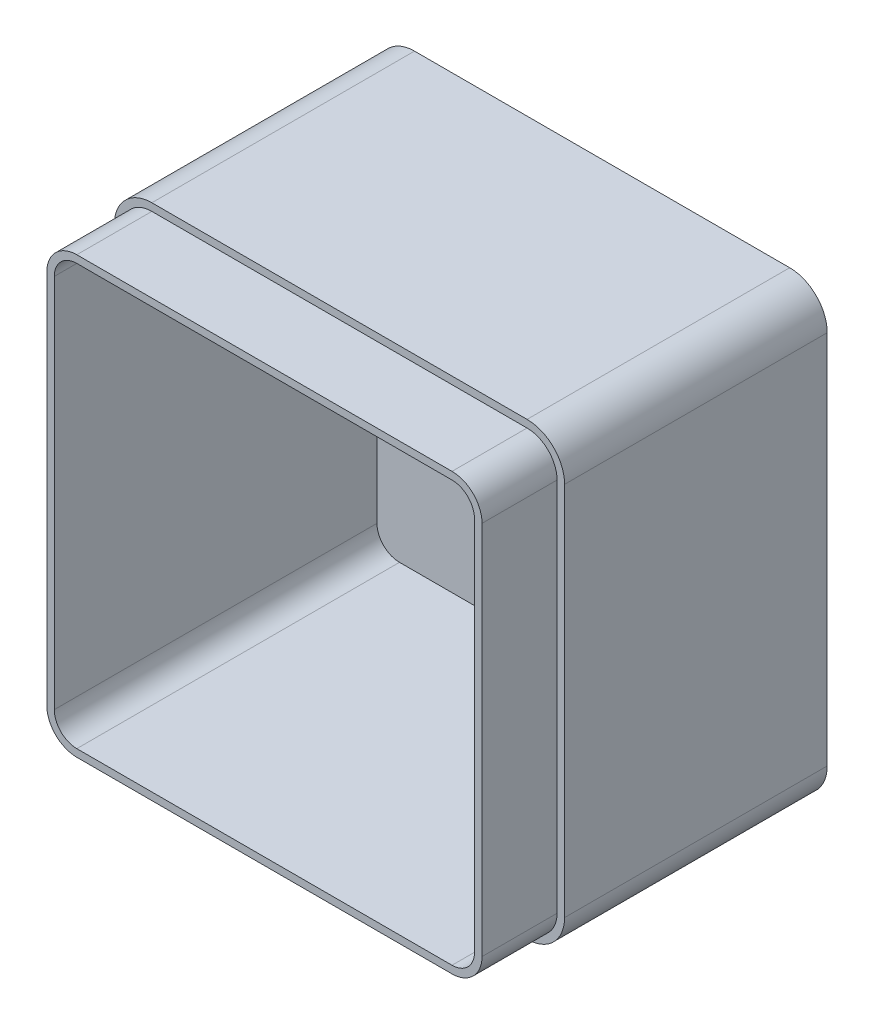
ISO-10303-21;
HEADER;
FILE_DESCRIPTION(('STEP AP214'),'2;1');
FILE_NAME('part.step','',(''),(''),'','','');
FILE_SCHEMA(('AUTOMOTIVE_DESIGN { 1 0 10303 214 1 1 1 1 }'));
ENDSEC;
DATA;
#1=APPLICATION_CONTEXT('core data for automotive mechanical design processes');
#2=APPLICATION_PROTOCOL_DEFINITION('international standard','automotive_design',2000,#1);
#3=PRODUCT_CONTEXT('',#1,'mechanical');
#4=PRODUCT('Part','Part','',(#3));
#5=PRODUCT_RELATED_PRODUCT_CATEGORY('part','',(#4));
#6=PRODUCT_DEFINITION_FORMATION('','',#4);
#7=PRODUCT_DEFINITION_CONTEXT('part definition',#1,'design');
#8=PRODUCT_DEFINITION('design','',#6,#7);
#9=PRODUCT_DEFINITION_SHAPE('','',#8);
#10=(LENGTH_UNIT() NAMED_UNIT(*) SI_UNIT(.MILLI.,.METRE.));
#11=(NAMED_UNIT(*) PLANE_ANGLE_UNIT() SI_UNIT($,.RADIAN.));
#12=(NAMED_UNIT(*) SI_UNIT($,.STERADIAN.) SOLID_ANGLE_UNIT());
#13=UNCERTAINTY_MEASURE_WITH_UNIT(LENGTH_MEASURE(1.E-05),#10,'distance_accuracy_value','');
#14=(GEOMETRIC_REPRESENTATION_CONTEXT(3) GLOBAL_UNCERTAINTY_ASSIGNED_CONTEXT((#13)) GLOBAL_UNIT_ASSIGNED_CONTEXT((#10,
#11,#12)) REPRESENTATION_CONTEXT('',''));
#15=CARTESIAN_POINT('',(0.,0.,0.));
#16=DIRECTION('',(0.,0.,1.));
#17=DIRECTION('',(1.,0.,0.));
#18=AXIS2_PLACEMENT_3D('',#15,#16,#17);
#19=CARTESIAN_POINT('',(0.,0.,90.));
#20=DIRECTION('',(0.,0.,-1.));
#21=DIRECTION('',(-1.,0.,0.));
#22=AXIS2_PLACEMENT_3D('',#19,#20,#21);
#23=PLANE('',#22);
#24=DIRECTION('',(0.,-1.,0.));
#25=VECTOR('',#24,1.);
#26=CARTESIAN_POINT('',(4.,0.,90.));
#27=LINE('',#26,#25);
#28=CARTESIAN_POINT('',(4.,110.,90.));
#29=VERTEX_POINT('',#28);
#30=CARTESIAN_POINT('',(4.,9.99999999999999,90.));
#31=VERTEX_POINT('',#30);
#32=EDGE_CURVE('E304',#29,#31,#27,.T.);
#33=ORIENTED_EDGE('',*,*,#32,.F.);
#34=CARTESIAN_POINT('',(10.,110.,90.));
#35=DIRECTION('',(0.,0.,-1.));
#36=DIRECTION('',(-1.,0.,0.));
#37=AXIS2_PLACEMENT_3D('',#34,#35,#36);
#38=CIRCLE('',#37,6.);
#39=CARTESIAN_POINT('',(9.99999999999999,116.,90.));
#40=VERTEX_POINT('',#39);
#41=EDGE_CURVE('E287',#40,#29,#38,.F.);
#42=ORIENTED_EDGE('',*,*,#41,.F.);
#43=DIRECTION('',(-1.,0.,0.));
#44=VECTOR('',#43,1.);
#45=CARTESIAN_POINT('',(0.,116.,90.));
#46=LINE('',#45,#44);
#47=CARTESIAN_POINT('',(110.,116.,90.));
#48=VERTEX_POINT('',#47);
#49=EDGE_CURVE('E313',#48,#40,#46,.T.);
#50=ORIENTED_EDGE('',*,*,#49,.F.);
#51=CARTESIAN_POINT('',(110.,110.,90.));
#52=DIRECTION('',(0.,0.,-1.));
#53=DIRECTION('',(-1.,0.,0.));
#54=AXIS2_PLACEMENT_3D('',#51,#52,#53);
#55=CIRCLE('',#54,6.);
#56=CARTESIAN_POINT('',(116.,110.,90.));
#57=VERTEX_POINT('',#56);
#58=EDGE_CURVE('E336',#57,#48,#55,.F.);
#59=ORIENTED_EDGE('',*,*,#58,.F.);
#60=DIRECTION('',(0.,1.,0.));
#61=VECTOR('',#60,1.);
#62=CARTESIAN_POINT('',(116.,0.,90.));
#63=LINE('',#62,#61);
#64=CARTESIAN_POINT('',(116.,9.99999999999999,90.));
#65=VERTEX_POINT('',#64);
#66=EDGE_CURVE('E334',#65,#57,#63,.T.);
#67=ORIENTED_EDGE('',*,*,#66,.F.);
#68=CARTESIAN_POINT('',(110.,10.,90.));
#69=DIRECTION('',(0.,0.,-1.));
#70=DIRECTION('',(-1.,0.,0.));
#71=AXIS2_PLACEMENT_3D('',#68,#69,#70);
#72=CIRCLE('',#71,6.);
#73=CARTESIAN_POINT('',(110.,4.,90.));
#74=VERTEX_POINT('',#73);
#75=EDGE_CURVE('E331',#74,#65,#72,.F.);
#76=ORIENTED_EDGE('',*,*,#75,.F.);
#77=DIRECTION('',(1.,0.,0.));
#78=VECTOR('',#77,1.);
#79=CARTESIAN_POINT('',(0.,4.,90.));
#80=LINE('',#79,#78);
#81=CARTESIAN_POINT('',(9.99999999999999,4.,90.));
#82=VERTEX_POINT('',#81);
#83=EDGE_CURVE('E329',#82,#74,#80,.T.);
#84=ORIENTED_EDGE('',*,*,#83,.F.);
#85=CARTESIAN_POINT('',(10.,10.,90.));
#86=DIRECTION('',(0.,0.,-1.));
#87=DIRECTION('',(-1.,0.,0.));
#88=AXIS2_PLACEMENT_3D('',#85,#86,#87);
#89=CIRCLE('',#88,6.);
#90=EDGE_CURVE('E320',#31,#82,#89,.F.);
#91=ORIENTED_EDGE('',*,*,#90,.F.);
#92=EDGE_LOOP('',(#33,#42,#50,#59,#67,#76,#84,#91));
#93=FACE_BOUND('',#92,.T.);
#94=CARTESIAN_POINT('',(10.,110.,90.));
#95=DIRECTION('',(0.,0.,1.));
#96=DIRECTION('',(1.,0.,0.));
#97=AXIS2_PLACEMENT_3D('',#94,#95,#96);
#98=CIRCLE('',#97,8.);
#99=CARTESIAN_POINT('',(9.99999999999999,118.,90.));
#100=VERTEX_POINT('',#99);
#101=CARTESIAN_POINT('',(2.,110.,90.));
#102=VERTEX_POINT('',#101);
#103=EDGE_CURVE('E239',#100,#102,#98,.T.);
#104=ORIENTED_EDGE('',*,*,#103,.T.);
#105=DIRECTION('',(0.,-1.,0.));
#106=VECTOR('',#105,1.);
#107=CARTESIAN_POINT('',(2.,110.,90.));
#108=LINE('',#107,#106);
#109=CARTESIAN_POINT('',(2.,9.99999999999999,90.));
#110=VERTEX_POINT('',#109);
#111=EDGE_CURVE('E199',#102,#110,#108,.T.);
#112=ORIENTED_EDGE('',*,*,#111,.T.);
#113=CARTESIAN_POINT('',(10.,10.,90.));
#114=DIRECTION('',(0.,0.,1.));
#115=DIRECTION('',(1.,0.,0.));
#116=AXIS2_PLACEMENT_3D('',#113,#114,#115);
#117=CIRCLE('',#116,8.);
#118=CARTESIAN_POINT('',(9.99999999999999,2.,90.));
#119=VERTEX_POINT('',#118);
#120=EDGE_CURVE('E48',#110,#119,#117,.T.);
#121=ORIENTED_EDGE('',*,*,#120,.T.);
#122=DIRECTION('',(1.,0.,0.));
#123=VECTOR('',#122,1.);
#124=CARTESIAN_POINT('',(9.99999999999999,2.,90.));
#125=LINE('',#124,#123);
#126=CARTESIAN_POINT('',(110.,2.,90.));
#127=VERTEX_POINT('',#126);
#128=EDGE_CURVE('E243',#119,#127,#125,.T.);
#129=ORIENTED_EDGE('',*,*,#128,.T.);
#130=CARTESIAN_POINT('',(110.,10.,90.));
#131=DIRECTION('',(0.,0.,1.));
#132=DIRECTION('',(1.,0.,0.));
#133=AXIS2_PLACEMENT_3D('',#130,#131,#132);
#134=CIRCLE('',#133,7.99999999999999);
#135=CARTESIAN_POINT('',(118.,10.,90.));
#136=VERTEX_POINT('',#135);
#137=EDGE_CURVE('E246',#127,#136,#134,.T.);
#138=ORIENTED_EDGE('',*,*,#137,.T.);
#139=DIRECTION('',(0.,1.,0.));
#140=VECTOR('',#139,1.);
#141=CARTESIAN_POINT('',(118.,9.99999999999999,90.));
#142=LINE('',#141,#140);
#143=CARTESIAN_POINT('',(118.,110.,90.));
#144=VERTEX_POINT('',#143);
#145=EDGE_CURVE('E249',#136,#144,#142,.T.);
#146=ORIENTED_EDGE('',*,*,#145,.T.);
#147=CARTESIAN_POINT('',(110.,110.,90.));
#148=DIRECTION('',(0.,0.,1.));
#149=DIRECTION('',(1.,0.,0.));
#150=AXIS2_PLACEMENT_3D('',#147,#148,#149);
#151=CIRCLE('',#150,7.99999999999999);
#152=CARTESIAN_POINT('',(110.,118.,90.));
#153=VERTEX_POINT('',#152);
#154=EDGE_CURVE('E222',#144,#153,#151,.T.);
#155=ORIENTED_EDGE('',*,*,#154,.T.);
#156=DIRECTION('',(-1.,0.,0.));
#157=VECTOR('',#156,1.);
#158=CARTESIAN_POINT('',(110.,118.,90.));
#159=LINE('',#158,#157);
#160=EDGE_CURVE('E219',#153,#100,#159,.T.);
#161=ORIENTED_EDGE('',*,*,#160,.T.);
#162=EDGE_LOOP('',(#104,#112,#121,#129,#138,#146,#155,#161));
#163=FACE_BOUND('',#162,.T.);
#164=ADVANCED_FACE('F33',(#93,#163),#23,.F.);
#165=CARTESIAN_POINT('',(4.,0.,90.));
#166=DIRECTION('',(1.,0.,0.));
#167=DIRECTION('',(0.,0.,-1.));
#168=AXIS2_PLACEMENT_3D('',#165,#166,#167);
#169=PLANE('',#168);
#170=DIRECTION('',(0.,-1.,0.));
#171=VECTOR('',#170,1.);
#172=CARTESIAN_POINT('',(4.,0.,4.));
#173=LINE('',#172,#171);
#174=CARTESIAN_POINT('',(4.,110.,4.));
#175=VERTEX_POINT('',#174);
#176=CARTESIAN_POINT('',(4.,9.99999999999999,4.));
#177=VERTEX_POINT('',#176);
#178=EDGE_CURVE('E281',#175,#177,#173,.T.);
#179=ORIENTED_EDGE('',*,*,#178,.F.);
#180=DIRECTION('',(0.,0.,-1.));
#181=VECTOR('',#180,1.);
#182=CARTESIAN_POINT('',(4.,110.,90.));
#183=LINE('',#182,#181);
#184=EDGE_CURVE('E288',#29,#175,#183,.T.);
#185=ORIENTED_EDGE('',*,*,#184,.F.);
#186=ORIENTED_EDGE('',*,*,#32,.T.);
#187=DIRECTION('',(0.,0.,-1.));
#188=VECTOR('',#187,1.);
#189=CARTESIAN_POINT('',(4.,9.99999999999999,90.));
#190=LINE('',#189,#188);
#191=EDGE_CURVE('E285',#177,#31,#190,.F.);
#192=ORIENTED_EDGE('',*,*,#191,.F.);
#193=EDGE_LOOP('',(#179,#185,#186,#192));
#194=FACE_BOUND('',#193,.T.);
#195=ADVANCED_FACE('F427',(#194),#169,.T.);
#196=CARTESIAN_POINT('',(0.,4.,90.));
#197=DIRECTION('',(0.,1.,0.));
#198=DIRECTION('',(0.,0.,1.));
#199=AXIS2_PLACEMENT_3D('',#196,#197,#198);
#200=PLANE('',#199);
#201=ORIENTED_EDGE('',*,*,#83,.T.);
#202=DIRECTION('',(0.,0.,1.));
#203=VECTOR('',#202,1.);
#204=CARTESIAN_POINT('',(110.,4.,90.));
#205=LINE('',#204,#203);
#206=CARTESIAN_POINT('',(110.,4.,4.));
#207=VERTEX_POINT('',#206);
#208=EDGE_CURVE('E311',#207,#74,#205,.T.);
#209=ORIENTED_EDGE('',*,*,#208,.F.);
#210=DIRECTION('',(1.,0.,0.));
#211=VECTOR('',#210,1.);
#212=CARTESIAN_POINT('',(0.,4.,4.));
#213=LINE('',#212,#211);
#214=CARTESIAN_POINT('',(9.99999999999999,4.,4.));
#215=VERTEX_POINT('',#214);
#216=EDGE_CURVE('E284',#215,#207,#213,.T.);
#217=ORIENTED_EDGE('',*,*,#216,.F.);
#218=DIRECTION('',(0.,0.,1.));
#219=VECTOR('',#218,1.);
#220=CARTESIAN_POINT('',(9.99999999999999,4.,90.));
#221=LINE('',#220,#219);
#222=EDGE_CURVE('E300',#82,#215,#221,.F.);
#223=ORIENTED_EDGE('',*,*,#222,.F.);
#224=EDGE_LOOP('',(#201,#209,#217,#223));
#225=FACE_BOUND('',#224,.T.);
#226=ADVANCED_FACE('F433',(#225),#200,.T.);
#227=CARTESIAN_POINT('',(116.,0.,90.));
#228=DIRECTION('',(-1.,0.,0.));
#229=DIRECTION('',(0.,0.,1.));
#230=AXIS2_PLACEMENT_3D('',#227,#228,#229);
#231=PLANE('',#230);
#232=ORIENTED_EDGE('',*,*,#66,.T.);
#233=DIRECTION('',(0.,0.,1.));
#234=VECTOR('',#233,1.);
#235=CARTESIAN_POINT('',(116.,110.,90.));
#236=LINE('',#235,#234);
#237=CARTESIAN_POINT('',(116.,110.,4.));
#238=VERTEX_POINT('',#237);
#239=EDGE_CURVE('E318',#238,#57,#236,.T.);
#240=ORIENTED_EDGE('',*,*,#239,.F.);
#241=DIRECTION('',(0.,1.,0.));
#242=VECTOR('',#241,1.);
#243=CARTESIAN_POINT('',(116.,0.,4.));
#244=LINE('',#243,#242);
#245=CARTESIAN_POINT('',(116.,9.99999999999999,4.));
#246=VERTEX_POINT('',#245);
#247=EDGE_CURVE('E294',#246,#238,#244,.T.);
#248=ORIENTED_EDGE('',*,*,#247,.F.);
#249=DIRECTION('',(0.,0.,1.));
#250=VECTOR('',#249,1.);
#251=CARTESIAN_POINT('',(116.,9.99999999999999,90.));
#252=LINE('',#251,#250);
#253=EDGE_CURVE('E314',#65,#246,#252,.F.);
#254=ORIENTED_EDGE('',*,*,#253,.F.);
#255=EDGE_LOOP('',(#232,#240,#248,#254));
#256=FACE_BOUND('',#255,.T.);
#257=ADVANCED_FACE('F462',(#256),#231,.T.);
#258=CARTESIAN_POINT('',(0.,116.,90.));
#259=DIRECTION('',(0.,-1.,0.));
#260=DIRECTION('',(0.,0.,-1.));
#261=AXIS2_PLACEMENT_3D('',#258,#259,#260);
#262=PLANE('',#261);
#263=ORIENTED_EDGE('',*,*,#49,.T.);
#264=DIRECTION('',(0.,0.,-1.));
#265=VECTOR('',#264,1.);
#266=CARTESIAN_POINT('',(9.99999999999999,116.,90.));
#267=LINE('',#266,#265);
#268=CARTESIAN_POINT('',(9.99999999999999,116.,4.));
#269=VERTEX_POINT('',#268);
#270=EDGE_CURVE('E317',#269,#40,#267,.F.);
#271=ORIENTED_EDGE('',*,*,#270,.F.);
#272=DIRECTION('',(-1.,0.,0.));
#273=VECTOR('',#272,1.);
#274=CARTESIAN_POINT('',(0.,116.,4.));
#275=LINE('',#274,#273);
#276=CARTESIAN_POINT('',(110.,116.,4.));
#277=VERTEX_POINT('',#276);
#278=EDGE_CURVE('E301',#277,#269,#275,.T.);
#279=ORIENTED_EDGE('',*,*,#278,.F.);
#280=DIRECTION('',(0.,0.,-1.));
#281=VECTOR('',#280,1.);
#282=CARTESIAN_POINT('',(110.,116.,90.));
#283=LINE('',#282,#281);
#284=EDGE_CURVE('E321',#48,#277,#283,.T.);
#285=ORIENTED_EDGE('',*,*,#284,.F.);
#286=EDGE_LOOP('',(#263,#271,#279,#285));
#287=FACE_BOUND('',#286,.T.);
#288=ADVANCED_FACE('F458',(#287),#262,.T.);
#289=CARTESIAN_POINT('',(0.,0.,4.));
#290=DIRECTION('',(0.,0.,-1.));
#291=DIRECTION('',(-1.,0.,0.));
#292=AXIS2_PLACEMENT_3D('',#289,#290,#291);
#293=PLANE('',#292);
#294=ORIENTED_EDGE('',*,*,#216,.T.);
#295=CARTESIAN_POINT('',(110.,10.,4.));
#296=DIRECTION('',(0.,0.,-1.));
#297=DIRECTION('',(-1.,0.,0.));
#298=AXIS2_PLACEMENT_3D('',#295,#296,#297);
#299=CIRCLE('',#298,6.);
#300=EDGE_CURVE('E296',#246,#207,#299,.T.);
#301=ORIENTED_EDGE('',*,*,#300,.F.);
#302=ORIENTED_EDGE('',*,*,#247,.T.);
#303=CARTESIAN_POINT('',(110.,110.,4.));
#304=DIRECTION('',(0.,0.,-1.));
#305=DIRECTION('',(-1.,0.,0.));
#306=AXIS2_PLACEMENT_3D('',#303,#304,#305);
#307=CIRCLE('',#306,6.);
#308=EDGE_CURVE('E299',#277,#238,#307,.T.);
#309=ORIENTED_EDGE('',*,*,#308,.F.);
#310=ORIENTED_EDGE('',*,*,#278,.T.);
#311=CARTESIAN_POINT('',(10.,110.,4.));
#312=DIRECTION('',(0.,0.,-1.));
#313=DIRECTION('',(-1.,0.,0.));
#314=AXIS2_PLACEMENT_3D('',#311,#312,#313);
#315=CIRCLE('',#314,6.);
#316=EDGE_CURVE('E297',#175,#269,#315,.T.);
#317=ORIENTED_EDGE('',*,*,#316,.F.);
#318=ORIENTED_EDGE('',*,*,#178,.T.);
#319=CARTESIAN_POINT('',(10.,10.,4.));
#320=DIRECTION('',(0.,0.,-1.));
#321=DIRECTION('',(-1.,0.,0.));
#322=AXIS2_PLACEMENT_3D('',#319,#320,#321);
#323=CIRCLE('',#322,6.);
#324=EDGE_CURVE('E291',#215,#177,#323,.T.);
#325=ORIENTED_EDGE('',*,*,#324,.F.);
#326=EDGE_LOOP('',(#294,#301,#302,#309,#310,#317,#318,#325));
#327=FACE_BOUND('',#326,.T.);
#328=ADVANCED_FACE('F454',(#327),#293,.F.);
#329=CARTESIAN_POINT('',(10.,10.,90.));
#330=DIRECTION('',(0.,0.,-1.));
#331=DIRECTION('',(-1.,0.,0.));
#332=AXIS2_PLACEMENT_3D('',#329,#330,#331);
#333=CYLINDRICAL_SURFACE('',#332,6.);
#334=ORIENTED_EDGE('',*,*,#90,.T.);
#335=ORIENTED_EDGE('',*,*,#222,.T.);
#336=ORIENTED_EDGE('',*,*,#324,.T.);
#337=ORIENTED_EDGE('',*,*,#191,.T.);
#338=EDGE_LOOP('',(#334,#335,#336,#337));
#339=FACE_BOUND('',#338,.T.);
#340=ADVANCED_FACE('F450',(#339),#333,.F.);
#341=CARTESIAN_POINT('',(110.,10.,90.));
#342=DIRECTION('',(0.,0.,-1.));
#343=DIRECTION('',(-1.,0.,0.));
#344=AXIS2_PLACEMENT_3D('',#341,#342,#343);
#345=CYLINDRICAL_SURFACE('',#344,6.);
#346=ORIENTED_EDGE('',*,*,#75,.T.);
#347=ORIENTED_EDGE('',*,*,#253,.T.);
#348=ORIENTED_EDGE('',*,*,#300,.T.);
#349=ORIENTED_EDGE('',*,*,#208,.T.);
#350=EDGE_LOOP('',(#346,#347,#348,#349));
#351=FACE_BOUND('',#350,.T.);
#352=ADVANCED_FACE('F446',(#351),#345,.F.);
#353=CARTESIAN_POINT('',(110.,110.,90.));
#354=DIRECTION('',(0.,0.,-1.));
#355=DIRECTION('',(-1.,0.,0.));
#356=AXIS2_PLACEMENT_3D('',#353,#354,#355);
#357=CYLINDRICAL_SURFACE('',#356,6.);
#358=ORIENTED_EDGE('',*,*,#58,.T.);
#359=ORIENTED_EDGE('',*,*,#284,.T.);
#360=ORIENTED_EDGE('',*,*,#308,.T.);
#361=ORIENTED_EDGE('',*,*,#239,.T.);
#362=EDGE_LOOP('',(#358,#359,#360,#361));
#363=FACE_BOUND('',#362,.T.);
#364=ADVANCED_FACE('F442',(#363),#357,.F.);
#365=CARTESIAN_POINT('',(10.,110.,90.));
#366=DIRECTION('',(0.,0.,-1.));
#367=DIRECTION('',(-1.,0.,0.));
#368=AXIS2_PLACEMENT_3D('',#365,#366,#367);
#369=CYLINDRICAL_SURFACE('',#368,6.);
#370=ORIENTED_EDGE('',*,*,#41,.T.);
#371=ORIENTED_EDGE('',*,*,#184,.T.);
#372=ORIENTED_EDGE('',*,*,#316,.T.);
#373=ORIENTED_EDGE('',*,*,#270,.T.);
#374=EDGE_LOOP('',(#370,#371,#372,#373));
#375=FACE_BOUND('',#374,.T.);
#376=ADVANCED_FACE('F439',(#375),#369,.F.);
#377=CARTESIAN_POINT('',(10.,110.,70.));
#378=DIRECTION('',(0.,0.,1.));
#379=DIRECTION('',(1.,0.,0.));
#380=AXIS2_PLACEMENT_3D('',#377,#378,#379);
#381=PLANE('',#380);
#382=DIRECTION('',(-1.,0.,0.));
#383=VECTOR('',#382,1.);
#384=CARTESIAN_POINT('',(110.,118.,70.));
#385=LINE('',#384,#383);
#386=CARTESIAN_POINT('',(110.,118.,70.));
#387=VERTEX_POINT('',#386);
#388=CARTESIAN_POINT('',(9.99999999999999,118.,70.));
#389=VERTEX_POINT('',#388);
#390=EDGE_CURVE('E205',#387,#389,#385,.T.);
#391=ORIENTED_EDGE('',*,*,#390,.F.);
#392=CARTESIAN_POINT('',(110.,110.,70.));
#393=DIRECTION('',(0.,0.,1.));
#394=DIRECTION('',(1.,0.,0.));
#395=AXIS2_PLACEMENT_3D('',#392,#393,#394);
#396=CIRCLE('',#395,7.99999999999999);
#397=CARTESIAN_POINT('',(118.,110.,70.));
#398=VERTEX_POINT('',#397);
#399=EDGE_CURVE('E235',#398,#387,#396,.T.);
#400=ORIENTED_EDGE('',*,*,#399,.F.);
#401=DIRECTION('',(0.,1.,0.));
#402=VECTOR('',#401,1.);
#403=CARTESIAN_POINT('',(118.,9.99999999999999,70.));
#404=LINE('',#403,#402);
#405=CARTESIAN_POINT('',(118.,10.,70.));
#406=VERTEX_POINT('',#405);
#407=EDGE_CURVE('E232',#406,#398,#404,.T.);
#408=ORIENTED_EDGE('',*,*,#407,.F.);
#409=CARTESIAN_POINT('',(110.,10.,70.));
#410=DIRECTION('',(0.,0.,1.));
#411=DIRECTION('',(1.,0.,0.));
#412=AXIS2_PLACEMENT_3D('',#409,#410,#411);
#413=CIRCLE('',#412,7.99999999999999);
#414=CARTESIAN_POINT('',(110.,2.,70.));
#415=VERTEX_POINT('',#414);
#416=EDGE_CURVE('E229',#415,#406,#413,.T.);
#417=ORIENTED_EDGE('',*,*,#416,.F.);
#418=DIRECTION('',(1.,0.,0.));
#419=VECTOR('',#418,1.);
#420=CARTESIAN_POINT('',(9.99999999999999,2.,70.));
#421=LINE('',#420,#419);
#422=CARTESIAN_POINT('',(9.99999999999999,2.,70.));
#423=VERTEX_POINT('',#422);
#424=EDGE_CURVE('E226',#423,#415,#421,.T.);
#425=ORIENTED_EDGE('',*,*,#424,.F.);
#426=CARTESIAN_POINT('',(10.,10.,70.));
#427=DIRECTION('',(0.,0.,1.));
#428=DIRECTION('',(1.,0.,0.));
#429=AXIS2_PLACEMENT_3D('',#426,#427,#428);
#430=CIRCLE('',#429,8.);
#431=CARTESIAN_POINT('',(2.,9.99999999999999,70.));
#432=VERTEX_POINT('',#431);
#433=EDGE_CURVE('E215',#432,#423,#430,.T.);
#434=ORIENTED_EDGE('',*,*,#433,.F.);
#435=DIRECTION('',(0.,-1.,0.));
#436=VECTOR('',#435,1.);
#437=CARTESIAN_POINT('',(2.,110.,70.));
#438=LINE('',#437,#436);
#439=CARTESIAN_POINT('',(2.,110.,70.));
#440=VERTEX_POINT('',#439);
#441=EDGE_CURVE('E197',#440,#432,#438,.T.);
#442=ORIENTED_EDGE('',*,*,#441,.F.);
#443=CARTESIAN_POINT('',(10.,110.,70.));
#444=DIRECTION('',(0.,0.,1.));
#445=DIRECTION('',(1.,0.,0.));
#446=AXIS2_PLACEMENT_3D('',#443,#444,#445);
#447=CIRCLE('',#446,8.);
#448=EDGE_CURVE('E211',#389,#440,#447,.T.);
#449=ORIENTED_EDGE('',*,*,#448,.F.);
#450=EDGE_LOOP('',(#391,#400,#408,#417,#425,#434,#442,#449));
#451=FACE_BOUND('',#450,.T.);
#452=CARTESIAN_POINT('',(10.,110.,70.));
#453=DIRECTION('',(0.,0.,1.));
#454=DIRECTION('',(1.,0.,0.));
#455=AXIS2_PLACEMENT_3D('',#452,#453,#454);
#456=CIRCLE('',#455,10.);
#457=CARTESIAN_POINT('',(10.,120.,70.));
#458=VERTEX_POINT('',#457);
#459=CARTESIAN_POINT('',(0.,110.,70.));
#460=VERTEX_POINT('',#459);
#461=EDGE_CURVE('E255',#458,#460,#456,.T.);
#462=ORIENTED_EDGE('',*,*,#461,.T.);
#463=DIRECTION('',(0.,-1.,0.));
#464=VECTOR('',#463,1.);
#465=CARTESIAN_POINT('',(0.,110.,70.));
#466=LINE('',#465,#464);
#467=CARTESIAN_POINT('',(0.,10.,70.));
#468=VERTEX_POINT('',#467);
#469=EDGE_CURVE('E268',#460,#468,#466,.T.);
#470=ORIENTED_EDGE('',*,*,#469,.T.);
#471=CARTESIAN_POINT('',(10.,10.,70.));
#472=DIRECTION('',(0.,0.,1.));
#473=DIRECTION('',(1.,0.,0.));
#474=AXIS2_PLACEMENT_3D('',#471,#472,#473);
#475=CIRCLE('',#474,10.);
#476=CARTESIAN_POINT('',(9.99999999999999,0.,70.));
#477=VERTEX_POINT('',#476);
#478=EDGE_CURVE('E270',#468,#477,#475,.T.);
#479=ORIENTED_EDGE('',*,*,#478,.T.);
#480=DIRECTION('',(1.,0.,0.));
#481=VECTOR('',#480,1.);
#482=CARTESIAN_POINT('',(9.99999999999999,0.,70.));
#483=LINE('',#482,#481);
#484=CARTESIAN_POINT('',(110.,0.,70.));
#485=VERTEX_POINT('',#484);
#486=EDGE_CURVE('E272',#477,#485,#483,.T.);
#487=ORIENTED_EDGE('',*,*,#486,.T.);
#488=CARTESIAN_POINT('',(110.,10.,70.));
#489=DIRECTION('',(0.,0.,1.));
#490=DIRECTION('',(1.,0.,0.));
#491=AXIS2_PLACEMENT_3D('',#488,#489,#490);
#492=CIRCLE('',#491,9.99999999999999);
#493=CARTESIAN_POINT('',(120.,10.,70.));
#494=VERTEX_POINT('',#493);
#495=EDGE_CURVE('E274',#485,#494,#492,.T.);
#496=ORIENTED_EDGE('',*,*,#495,.T.);
#497=DIRECTION('',(0.,1.,0.));
#498=VECTOR('',#497,1.);
#499=CARTESIAN_POINT('',(120.,10.,70.));
#500=LINE('',#499,#498);
#501=CARTESIAN_POINT('',(120.,110.,70.));
#502=VERTEX_POINT('',#501);
#503=EDGE_CURVE('E276',#494,#502,#500,.T.);
#504=ORIENTED_EDGE('',*,*,#503,.T.);
#505=CARTESIAN_POINT('',(110.,110.,70.));
#506=DIRECTION('',(0.,0.,1.));
#507=DIRECTION('',(1.,0.,0.));
#508=AXIS2_PLACEMENT_3D('',#505,#506,#507);
#509=CIRCLE('',#508,9.99999999999999);
#510=CARTESIAN_POINT('',(110.,120.,70.));
#511=VERTEX_POINT('',#510);
#512=EDGE_CURVE('E278',#502,#511,#509,.T.);
#513=ORIENTED_EDGE('',*,*,#512,.T.);
#514=DIRECTION('',(-1.,0.,0.));
#515=VECTOR('',#514,1.);
#516=CARTESIAN_POINT('',(110.,120.,70.));
#517=LINE('',#516,#515);
#518=EDGE_CURVE('E56',#511,#458,#517,.T.);
#519=ORIENTED_EDGE('',*,*,#518,.T.);
#520=EDGE_LOOP('',(#462,#470,#479,#487,#496,#504,#513,#519));
#521=FACE_BOUND('',#520,.T.);
#522=ADVANCED_FACE('F210',(#451,#521),#381,.T.);
#523=CARTESIAN_POINT('',(10.,110.,70.));
#524=DIRECTION('',(0.,0.,1.));
#525=DIRECTION('',(1.,0.,0.));
#526=AXIS2_PLACEMENT_3D('',#523,#524,#525);
#527=CYLINDRICAL_SURFACE('',#526,8.);
#528=ORIENTED_EDGE('',*,*,#103,.F.);
#529=DIRECTION('',(0.,0.,1.));
#530=VECTOR('',#529,1.);
#531=CARTESIAN_POINT('',(9.99999999999999,118.,70.));
#532=LINE('',#531,#530);
#533=EDGE_CURVE('E218',#389,#100,#532,.T.);
#534=ORIENTED_EDGE('',*,*,#533,.F.);
#535=ORIENTED_EDGE('',*,*,#448,.T.);
#536=DIRECTION('',(0.,0.,1.));
#537=VECTOR('',#536,1.);
#538=CARTESIAN_POINT('',(2.,110.,70.));
#539=LINE('',#538,#537);
#540=EDGE_CURVE('E194',#440,#102,#539,.T.);
#541=ORIENTED_EDGE('',*,*,#540,.T.);
#542=EDGE_LOOP('',(#528,#534,#535,#541));
#543=FACE_BOUND('',#542,.T.);
#544=ADVANCED_FACE('F217',(#543),#527,.T.);
#545=CARTESIAN_POINT('',(110.,118.,70.));
#546=DIRECTION('',(0.,1.,0.));
#547=DIRECTION('',(0.,0.,1.));
#548=AXIS2_PLACEMENT_3D('',#545,#546,#547);
#549=PLANE('',#548);
#550=ORIENTED_EDGE('',*,*,#160,.F.);
#551=DIRECTION('',(0.,0.,1.));
#552=VECTOR('',#551,1.);
#553=CARTESIAN_POINT('',(110.,118.,70.));
#554=LINE('',#553,#552);
#555=EDGE_CURVE('E256',#387,#153,#554,.T.);
#556=ORIENTED_EDGE('',*,*,#555,.F.);
#557=ORIENTED_EDGE('',*,*,#390,.T.);
#558=ORIENTED_EDGE('',*,*,#533,.T.);
#559=EDGE_LOOP('',(#550,#556,#557,#558));
#560=FACE_BOUND('',#559,.T.);
#561=ADVANCED_FACE('F473',(#560),#549,.T.);
#562=CARTESIAN_POINT('',(110.,110.,70.));
#563=DIRECTION('',(0.,0.,1.));
#564=DIRECTION('',(1.,0.,0.));
#565=AXIS2_PLACEMENT_3D('',#562,#563,#564);
#566=CYLINDRICAL_SURFACE('',#565,7.99999999999999);
#567=ORIENTED_EDGE('',*,*,#154,.F.);
#568=DIRECTION('',(0.,0.,1.));
#569=VECTOR('',#568,1.);
#570=CARTESIAN_POINT('',(118.,110.,70.));
#571=LINE('',#570,#569);
#572=EDGE_CURVE('E258',#398,#144,#571,.T.);
#573=ORIENTED_EDGE('',*,*,#572,.F.);
#574=ORIENTED_EDGE('',*,*,#399,.T.);
#575=ORIENTED_EDGE('',*,*,#555,.T.);
#576=EDGE_LOOP('',(#567,#573,#574,#575));
#577=FACE_BOUND('',#576,.T.);
#578=ADVANCED_FACE('F488',(#577),#566,.T.);
#579=CARTESIAN_POINT('',(118.,9.99999999999999,70.));
#580=DIRECTION('',(1.,0.,0.));
#581=DIRECTION('',(0.,0.,-1.));
#582=AXIS2_PLACEMENT_3D('',#579,#580,#581);
#583=PLANE('',#582);
#584=ORIENTED_EDGE('',*,*,#145,.F.);
#585=DIRECTION('',(0.,0.,1.));
#586=VECTOR('',#585,1.);
#587=CARTESIAN_POINT('',(118.,10.,70.));
#588=LINE('',#587,#586);
#589=EDGE_CURVE('E260',#406,#136,#588,.T.);
#590=ORIENTED_EDGE('',*,*,#589,.F.);
#591=ORIENTED_EDGE('',*,*,#407,.T.);
#592=ORIENTED_EDGE('',*,*,#572,.T.);
#593=EDGE_LOOP('',(#584,#590,#591,#592));
#594=FACE_BOUND('',#593,.T.);
#595=ADVANCED_FACE('F484',(#594),#583,.T.);
#596=CARTESIAN_POINT('',(110.,10.,70.));
#597=DIRECTION('',(0.,0.,1.));
#598=DIRECTION('',(1.,0.,0.));
#599=AXIS2_PLACEMENT_3D('',#596,#597,#598);
#600=CYLINDRICAL_SURFACE('',#599,7.99999999999999);
#601=ORIENTED_EDGE('',*,*,#137,.F.);
#602=DIRECTION('',(0.,0.,1.));
#603=VECTOR('',#602,1.);
#604=CARTESIAN_POINT('',(110.,2.,70.));
#605=LINE('',#604,#603);
#606=EDGE_CURVE('E262',#415,#127,#605,.T.);
#607=ORIENTED_EDGE('',*,*,#606,.F.);
#608=ORIENTED_EDGE('',*,*,#416,.T.);
#609=ORIENTED_EDGE('',*,*,#589,.T.);
#610=EDGE_LOOP('',(#601,#607,#608,#609));
#611=FACE_BOUND('',#610,.T.);
#612=ADVANCED_FACE('F480',(#611),#600,.T.);
#613=CARTESIAN_POINT('',(9.99999999999999,2.,70.));
#614=DIRECTION('',(0.,-1.,0.));
#615=DIRECTION('',(0.,0.,-1.));
#616=AXIS2_PLACEMENT_3D('',#613,#614,#615);
#617=PLANE('',#616);
#618=ORIENTED_EDGE('',*,*,#128,.F.);
#619=DIRECTION('',(0.,0.,1.));
#620=VECTOR('',#619,1.);
#621=CARTESIAN_POINT('',(9.99999999999999,2.,70.));
#622=LINE('',#621,#620);
#623=EDGE_CURVE('E264',#423,#119,#622,.T.);
#624=ORIENTED_EDGE('',*,*,#623,.F.);
#625=ORIENTED_EDGE('',*,*,#424,.T.);
#626=ORIENTED_EDGE('',*,*,#606,.T.);
#627=EDGE_LOOP('',(#618,#624,#625,#626));
#628=FACE_BOUND('',#627,.T.);
#629=ADVANCED_FACE('F477',(#628),#617,.T.);
#630=CARTESIAN_POINT('',(10.,10.,70.));
#631=DIRECTION('',(0.,0.,1.));
#632=DIRECTION('',(1.,0.,0.));
#633=AXIS2_PLACEMENT_3D('',#630,#631,#632);
#634=CYLINDRICAL_SURFACE('',#633,8.);
#635=ORIENTED_EDGE('',*,*,#120,.F.);
#636=DIRECTION('',(0.,0.,1.));
#637=VECTOR('',#636,1.);
#638=CARTESIAN_POINT('',(2.,9.99999999999999,70.));
#639=LINE('',#638,#637);
#640=EDGE_CURVE('E204',#432,#110,#639,.T.);
#641=ORIENTED_EDGE('',*,*,#640,.F.);
#642=ORIENTED_EDGE('',*,*,#433,.T.);
#643=ORIENTED_EDGE('',*,*,#623,.T.);
#644=EDGE_LOOP('',(#635,#641,#642,#643));
#645=FACE_BOUND('',#644,.T.);
#646=ADVANCED_FACE('F422',(#645),#634,.T.);
#647=CARTESIAN_POINT('',(2.,110.,70.));
#648=DIRECTION('',(-1.,0.,0.));
#649=DIRECTION('',(0.,0.,1.));
#650=AXIS2_PLACEMENT_3D('',#647,#648,#649);
#651=PLANE('',#650);
#652=ORIENTED_EDGE('',*,*,#111,.F.);
#653=ORIENTED_EDGE('',*,*,#540,.F.);
#654=ORIENTED_EDGE('',*,*,#441,.T.);
#655=ORIENTED_EDGE('',*,*,#640,.T.);
#656=EDGE_LOOP('',(#652,#653,#654,#655));
#657=FACE_BOUND('',#656,.T.);
#658=ADVANCED_FACE('F196',(#657),#651,.T.);
#659=CARTESIAN_POINT('',(0.,0.,0.));
#660=DIRECTION('',(0.,0.,-1.));
#661=DIRECTION('',(-1.,0.,0.));
#662=AXIS2_PLACEMENT_3D('',#659,#660,#661);
#663=PLANE('',#662);
#664=DIRECTION('',(1.,0.,0.));
#665=VECTOR('',#664,1.);
#666=CARTESIAN_POINT('',(0.,0.,0.));
#667=LINE('',#666,#665);
#668=CARTESIAN_POINT('',(10.,0.,0.));
#669=VERTEX_POINT('',#668);
#670=CARTESIAN_POINT('',(110.,0.,0.));
#671=VERTEX_POINT('',#670);
#672=EDGE_CURVE('E344',#669,#671,#667,.T.);
#673=ORIENTED_EDGE('',*,*,#672,.F.);
#674=CARTESIAN_POINT('',(10.,10.,0.));
#675=DIRECTION('',(0.,0.,-1.));
#676=DIRECTION('',(-1.,0.,0.));
#677=AXIS2_PLACEMENT_3D('',#674,#675,#676);
#678=CIRCLE('',#677,10.);
#679=CARTESIAN_POINT('',(0.,10.,0.));
#680=VERTEX_POINT('',#679);
#681=EDGE_CURVE('E364',#669,#680,#678,.T.);
#682=ORIENTED_EDGE('',*,*,#681,.T.);
#683=DIRECTION('',(0.,-1.,0.));
#684=VECTOR('',#683,1.);
#685=CARTESIAN_POINT('',(0.,0.,0.));
#686=LINE('',#685,#684);
#687=CARTESIAN_POINT('',(0.,110.,0.));
#688=VERTEX_POINT('',#687);
#689=EDGE_CURVE('E324',#688,#680,#686,.T.);
#690=ORIENTED_EDGE('',*,*,#689,.F.);
#691=CARTESIAN_POINT('',(10.,110.,0.));
#692=DIRECTION('',(0.,0.,-1.));
#693=DIRECTION('',(-1.,0.,0.));
#694=AXIS2_PLACEMENT_3D('',#691,#692,#693);
#695=CIRCLE('',#694,10.);
#696=CARTESIAN_POINT('',(10.,120.,0.));
#697=VERTEX_POINT('',#696);
#698=EDGE_CURVE('E358',#688,#697,#695,.T.);
#699=ORIENTED_EDGE('',*,*,#698,.T.);
#700=DIRECTION('',(-1.,0.,0.));
#701=VECTOR('',#700,1.);
#702=CARTESIAN_POINT('',(0.,120.,0.));
#703=LINE('',#702,#701);
#704=CARTESIAN_POINT('',(110.,120.,0.));
#705=VERTEX_POINT('',#704);
#706=EDGE_CURVE('E350',#705,#697,#703,.T.);
#707=ORIENTED_EDGE('',*,*,#706,.F.);
#708=CARTESIAN_POINT('',(110.,110.,0.));
#709=DIRECTION('',(0.,0.,-1.));
#710=DIRECTION('',(-1.,0.,0.));
#711=AXIS2_PLACEMENT_3D('',#708,#709,#710);
#712=CIRCLE('',#711,10.);
#713=CARTESIAN_POINT('',(120.,110.,0.));
#714=VERTEX_POINT('',#713);
#715=EDGE_CURVE('E360',#705,#714,#712,.T.);
#716=ORIENTED_EDGE('',*,*,#715,.T.);
#717=DIRECTION('',(0.,1.,0.));
#718=VECTOR('',#717,1.);
#719=CARTESIAN_POINT('',(120.,0.,0.));
#720=LINE('',#719,#718);
#721=CARTESIAN_POINT('',(120.,10.,0.));
#722=VERTEX_POINT('',#721);
#723=EDGE_CURVE('E347',#722,#714,#720,.T.);
#724=ORIENTED_EDGE('',*,*,#723,.F.);
#725=CARTESIAN_POINT('',(110.,10.,0.));
#726=DIRECTION('',(0.,0.,-1.));
#727=DIRECTION('',(-1.,0.,0.));
#728=AXIS2_PLACEMENT_3D('',#725,#726,#727);
#729=CIRCLE('',#728,10.);
#730=EDGE_CURVE('E362',#722,#671,#729,.T.);
#731=ORIENTED_EDGE('',*,*,#730,.T.);
#732=EDGE_LOOP('',(#673,#682,#690,#699,#707,#716,#724,#731));
#733=FACE_BOUND('',#732,.T.);
#734=ADVANCED_FACE('F414',(#733),#663,.T.);
#735=CARTESIAN_POINT('',(10.,110.,90.));
#736=DIRECTION('',(0.,0.,-1.));
#737=DIRECTION('',(-1.,0.,0.));
#738=AXIS2_PLACEMENT_3D('',#735,#736,#737);
#739=CYLINDRICAL_SURFACE('',#738,10.);
#740=DIRECTION('',(0.,0.,-1.));
#741=VECTOR('',#740,1.);
#742=CARTESIAN_POINT('',(0.,110.,90.));
#743=LINE('',#742,#741);
#744=EDGE_CURVE('E366',#460,#688,#743,.T.);
#745=ORIENTED_EDGE('',*,*,#744,.F.);
#746=ORIENTED_EDGE('',*,*,#461,.F.);
#747=DIRECTION('',(0.,0.,-1.));
#748=VECTOR('',#747,1.);
#749=CARTESIAN_POINT('',(10.,120.,90.));
#750=LINE('',#749,#748);
#751=EDGE_CURVE('E41',#697,#458,#750,.F.);
#752=ORIENTED_EDGE('',*,*,#751,.F.);
#753=ORIENTED_EDGE('',*,*,#698,.F.);
#754=EDGE_LOOP('',(#745,#746,#752,#753));
#755=FACE_BOUND('',#754,.T.);
#756=ADVANCED_FACE('F35',(#755),#739,.T.);
#757=CARTESIAN_POINT('',(110.,110.,90.));
#758=DIRECTION('',(0.,0.,-1.));
#759=DIRECTION('',(-1.,0.,0.));
#760=AXIS2_PLACEMENT_3D('',#757,#758,#759);
#761=CYLINDRICAL_SURFACE('',#760,10.);
#762=DIRECTION('',(0.,0.,-1.));
#763=VECTOR('',#762,1.);
#764=CARTESIAN_POINT('',(110.,120.,90.));
#765=LINE('',#764,#763);
#766=EDGE_CURVE('E11',#511,#705,#765,.T.);
#767=ORIENTED_EDGE('',*,*,#766,.F.);
#768=ORIENTED_EDGE('',*,*,#512,.F.);
#769=DIRECTION('',(0.,0.,-1.));
#770=VECTOR('',#769,1.);
#771=CARTESIAN_POINT('',(120.,110.,90.));
#772=LINE('',#771,#770);
#773=EDGE_CURVE('E371',#714,#502,#772,.F.);
#774=ORIENTED_EDGE('',*,*,#773,.F.);
#775=ORIENTED_EDGE('',*,*,#715,.F.);
#776=EDGE_LOOP('',(#767,#768,#774,#775));
#777=FACE_BOUND('',#776,.T.);
#778=ADVANCED_FACE('F412',(#777),#761,.T.);
#779=CARTESIAN_POINT('',(0.,120.,90.));
#780=DIRECTION('',(0.,-1.,0.));
#781=DIRECTION('',(0.,0.,-1.));
#782=AXIS2_PLACEMENT_3D('',#779,#780,#781);
#783=PLANE('',#782);
#784=ORIENTED_EDGE('',*,*,#518,.F.);
#785=ORIENTED_EDGE('',*,*,#766,.T.);
#786=ORIENTED_EDGE('',*,*,#706,.T.);
#787=ORIENTED_EDGE('',*,*,#751,.T.);
#788=EDGE_LOOP('',(#784,#785,#786,#787));
#789=FACE_BOUND('',#788,.T.);
#790=ADVANCED_FACE('F378',(#789),#783,.F.);
#791=CARTESIAN_POINT('',(110.,10.,90.));
#792=DIRECTION('',(0.,0.,-1.));
#793=DIRECTION('',(-1.,0.,0.));
#794=AXIS2_PLACEMENT_3D('',#791,#792,#793);
#795=CYLINDRICAL_SURFACE('',#794,10.);
#796=DIRECTION('',(0.,0.,-1.));
#797=VECTOR('',#796,1.);
#798=CARTESIAN_POINT('',(120.,10.,90.));
#799=LINE('',#798,#797);
#800=EDGE_CURVE('E374',#494,#722,#799,.T.);
#801=ORIENTED_EDGE('',*,*,#800,.F.);
#802=ORIENTED_EDGE('',*,*,#495,.F.);
#803=DIRECTION('',(0.,0.,-1.));
#804=VECTOR('',#803,1.);
#805=CARTESIAN_POINT('',(110.,0.,90.));
#806=LINE('',#805,#804);
#807=EDGE_CURVE('E353',#671,#485,#806,.F.);
#808=ORIENTED_EDGE('',*,*,#807,.F.);
#809=ORIENTED_EDGE('',*,*,#730,.F.);
#810=EDGE_LOOP('',(#801,#802,#808,#809));
#811=FACE_BOUND('',#810,.T.);
#812=ADVANCED_FACE('F403',(#811),#795,.T.);
#813=CARTESIAN_POINT('',(120.,0.,90.));
#814=DIRECTION('',(-1.,0.,0.));
#815=DIRECTION('',(0.,0.,1.));
#816=AXIS2_PLACEMENT_3D('',#813,#814,#815);
#817=PLANE('',#816);
#818=ORIENTED_EDGE('',*,*,#503,.F.);
#819=ORIENTED_EDGE('',*,*,#800,.T.);
#820=ORIENTED_EDGE('',*,*,#723,.T.);
#821=ORIENTED_EDGE('',*,*,#773,.T.);
#822=EDGE_LOOP('',(#818,#819,#820,#821));
#823=FACE_BOUND('',#822,.T.);
#824=ADVANCED_FACE('F408',(#823),#817,.F.);
#825=CARTESIAN_POINT('',(10.,10.,90.));
#826=DIRECTION('',(0.,0.,-1.));
#827=DIRECTION('',(-1.,0.,0.));
#828=AXIS2_PLACEMENT_3D('',#825,#826,#827);
#829=CYLINDRICAL_SURFACE('',#828,10.);
#830=DIRECTION('',(0.,0.,-1.));
#831=VECTOR('',#830,1.);
#832=CARTESIAN_POINT('',(10.,0.,90.));
#833=LINE('',#832,#831);
#834=EDGE_CURVE('E356',#477,#669,#833,.T.);
#835=ORIENTED_EDGE('',*,*,#834,.F.);
#836=ORIENTED_EDGE('',*,*,#478,.F.);
#837=DIRECTION('',(0.,0.,-1.));
#838=VECTOR('',#837,1.);
#839=CARTESIAN_POINT('',(0.,10.,90.));
#840=LINE('',#839,#838);
#841=EDGE_CURVE('E368',#680,#468,#840,.F.);
#842=ORIENTED_EDGE('',*,*,#841,.F.);
#843=ORIENTED_EDGE('',*,*,#681,.F.);
#844=EDGE_LOOP('',(#835,#836,#842,#843));
#845=FACE_BOUND('',#844,.T.);
#846=ADVANCED_FACE('F393',(#845),#829,.T.);
#847=CARTESIAN_POINT('',(0.,0.,90.));
#848=DIRECTION('',(0.,1.,0.));
#849=DIRECTION('',(0.,0.,1.));
#850=AXIS2_PLACEMENT_3D('',#847,#848,#849);
#851=PLANE('',#850);
#852=ORIENTED_EDGE('',*,*,#486,.F.);
#853=ORIENTED_EDGE('',*,*,#834,.T.);
#854=ORIENTED_EDGE('',*,*,#672,.T.);
#855=ORIENTED_EDGE('',*,*,#807,.T.);
#856=EDGE_LOOP('',(#852,#853,#854,#855));
#857=FACE_BOUND('',#856,.T.);
#858=ADVANCED_FACE('F398',(#857),#851,.F.);
#859=CARTESIAN_POINT('',(0.,0.,90.));
#860=DIRECTION('',(1.,0.,0.));
#861=DIRECTION('',(0.,0.,-1.));
#862=AXIS2_PLACEMENT_3D('',#859,#860,#861);
#863=PLANE('',#862);
#864=ORIENTED_EDGE('',*,*,#469,.F.);
#865=ORIENTED_EDGE('',*,*,#744,.T.);
#866=ORIENTED_EDGE('',*,*,#689,.T.);
#867=ORIENTED_EDGE('',*,*,#841,.T.);
#868=EDGE_LOOP('',(#864,#865,#866,#867));
#869=FACE_BOUND('',#868,.T.);
#870=ADVANCED_FACE('F388',(#869),#863,.F.);
#871=CLOSED_SHELL('',(#164,#195,#226,#257,#288,#328,#340,#352,#364,#376,#522,#544,#561,#578,
#595,#612,#629,#646,#658,#734,#756,#778,#790,#812,#824,#846,#858,#870));
#872=MANIFOLD_SOLID_BREP('B2',#871);
#873=ADVANCED_BREP_SHAPE_REPRESENTATION('',(#18,#872),#14);
#874=SHAPE_DEFINITION_REPRESENTATION(#9,#873);
ENDSEC;
END-ISO-10303-21;
